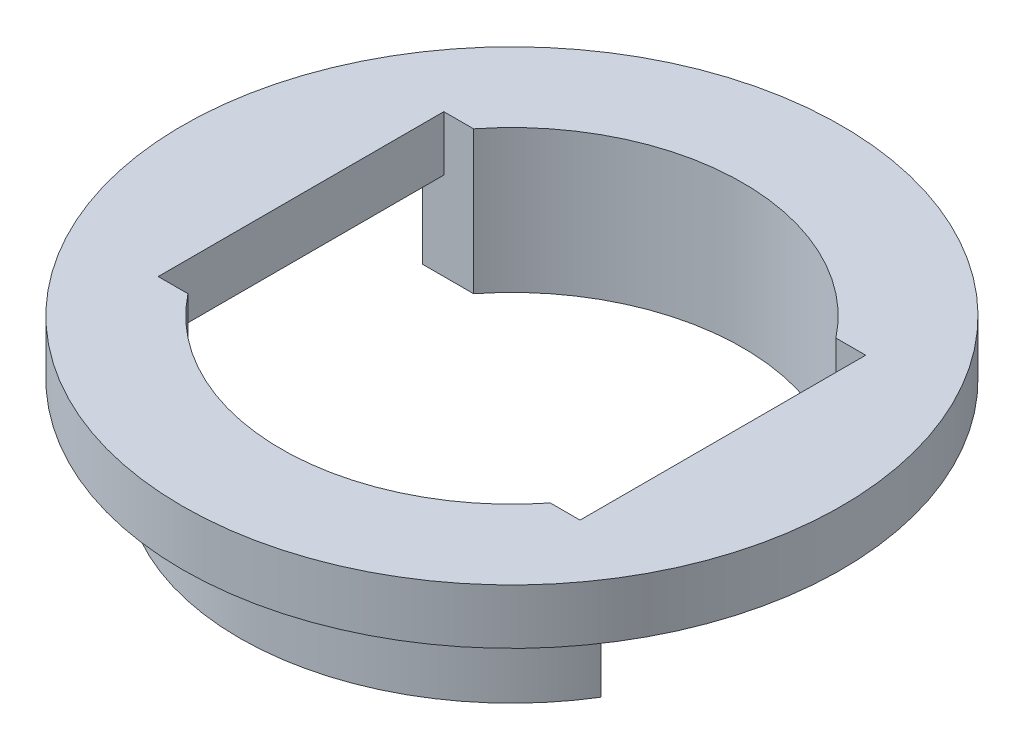
ISO-10303-21;
HEADER;
FILE_DESCRIPTION(('STEP AP214'),'2;1');
FILE_NAME('part.step','',(''),(''),'','','');
FILE_SCHEMA(('AUTOMOTIVE_DESIGN { 1 0 10303 214 1 1 1 1 }'));
ENDSEC;
DATA;
#1=APPLICATION_CONTEXT('core data for automotive mechanical design processes');
#2=APPLICATION_PROTOCOL_DEFINITION('international standard','automotive_design',2000,#1);
#3=PRODUCT_CONTEXT('',#1,'mechanical');
#4=PRODUCT('Part','Part','',(#3));
#5=PRODUCT_RELATED_PRODUCT_CATEGORY('part','',(#4));
#6=PRODUCT_DEFINITION_FORMATION('','',#4);
#7=PRODUCT_DEFINITION_CONTEXT('part definition',#1,'design');
#8=PRODUCT_DEFINITION('design','',#6,#7);
#9=PRODUCT_DEFINITION_SHAPE('','',#8);
#10=(LENGTH_UNIT() NAMED_UNIT(*) SI_UNIT(.MILLI.,.METRE.));
#11=(NAMED_UNIT(*) PLANE_ANGLE_UNIT() SI_UNIT($,.RADIAN.));
#12=(NAMED_UNIT(*) SI_UNIT($,.STERADIAN.) SOLID_ANGLE_UNIT());
#13=UNCERTAINTY_MEASURE_WITH_UNIT(LENGTH_MEASURE(1.E-05),#10,'distance_accuracy_value','');
#14=(GEOMETRIC_REPRESENTATION_CONTEXT(3) GLOBAL_UNCERTAINTY_ASSIGNED_CONTEXT((#13)) GLOBAL_UNIT_ASSIGNED_CONTEXT((#10,
#11,#12)) REPRESENTATION_CONTEXT('',''));
#15=CARTESIAN_POINT('',(0.,0.,0.));
#16=DIRECTION('',(0.,0.,1.));
#17=DIRECTION('',(1.,0.,0.));
#18=AXIS2_PLACEMENT_3D('',#15,#16,#17);
#19=CARTESIAN_POINT('',(0.,2.5,-6.50000000000001));
#20=DIRECTION('',(0.,0.,-1.));
#21=DIRECTION('',(-1.,0.,0.));
#22=AXIS2_PLACEMENT_3D('',#19,#20,#21);
#23=PLANE('',#22);
#24=DIRECTION('',(1.,0.,0.));
#25=VECTOR('',#24,1.);
#26=CARTESIAN_POINT('',(0.,2.5,-6.50000000000001));
#27=LINE('',#26,#25);
#28=CARTESIAN_POINT('',(8.24621125123532,2.5,-6.5));
#29=VERTEX_POINT('',#28);
#30=CARTESIAN_POINT('',(9.6,2.5,-6.5));
#31=VERTEX_POINT('',#30);
#32=EDGE_CURVE('E217',#29,#31,#27,.T.);
#33=ORIENTED_EDGE('',*,*,#32,.F.);
#34=DIRECTION('',(0.,1.,0.));
#35=VECTOR('',#34,1.);
#36=CARTESIAN_POINT('',(8.24621125123532,-4.,-6.5));
#37=LINE('',#36,#35);
#38=CARTESIAN_POINT('',(8.24621125123532,-4.,-6.5));
#39=VERTEX_POINT('',#38);
#40=EDGE_CURVE('E54',#39,#29,#37,.T.);
#41=ORIENTED_EDGE('',*,*,#40,.F.);
#42=DIRECTION('',(-1.,0.,0.));
#43=VECTOR('',#42,1.);
#44=CARTESIAN_POINT('',(0.,-4.,-6.5));
#45=LINE('',#44,#43);
#46=CARTESIAN_POINT('',(10.5598295440788,-4.,-6.5));
#47=VERTEX_POINT('',#46);
#48=EDGE_CURVE('E244',#47,#39,#45,.T.);
#49=ORIENTED_EDGE('',*,*,#48,.F.);
#50=DIRECTION('',(0.,1.,0.));
#51=VECTOR('',#50,1.);
#52=CARTESIAN_POINT('',(10.5598295440788,-4.,-6.5));
#53=LINE('',#52,#51);
#54=CARTESIAN_POINT('',(10.5598295440788,0.,-6.5));
#55=VERTEX_POINT('',#54);
#56=EDGE_CURVE('E227',#47,#55,#53,.T.);
#57=ORIENTED_EDGE('',*,*,#56,.T.);
#58=DIRECTION('',(-1.,0.,0.));
#59=VECTOR('',#58,1.);
#60=CARTESIAN_POINT('',(0.,0.,-6.5));
#61=LINE('',#60,#59);
#62=CARTESIAN_POINT('',(9.6,0.,-6.5));
#63=VERTEX_POINT('',#62);
#64=EDGE_CURVE('E223',#55,#63,#61,.T.);
#65=ORIENTED_EDGE('',*,*,#64,.T.);
#66=DIRECTION('',(0.,-1.,0.));
#67=VECTOR('',#66,1.);
#68=CARTESIAN_POINT('',(9.6,2.5,-6.5));
#69=LINE('',#68,#67);
#70=EDGE_CURVE('E176',#31,#63,#69,.T.);
#71=ORIENTED_EDGE('',*,*,#70,.F.);
#72=EDGE_LOOP('',(#33,#41,#49,#57,#65,#71));
#73=FACE_BOUND('',#72,.T.);
#74=ADVANCED_FACE('F38',(#73),#23,.F.);
#75=CARTESIAN_POINT('',(0.,2.5,6.49999999999999));
#76=DIRECTION('',(0.,0.,1.));
#77=DIRECTION('',(1.,0.,0.));
#78=AXIS2_PLACEMENT_3D('',#75,#76,#77);
#79=PLANE('',#78);
#80=DIRECTION('',(-1.,0.,0.));
#81=VECTOR('',#80,1.);
#82=CARTESIAN_POINT('',(0.,2.5,6.49999999999999));
#83=LINE('',#82,#81);
#84=CARTESIAN_POINT('',(-8.24621125123532,2.5,6.5));
#85=VERTEX_POINT('',#84);
#86=CARTESIAN_POINT('',(-9.6,2.5,6.5));
#87=VERTEX_POINT('',#86);
#88=EDGE_CURVE('E161',#85,#87,#83,.T.);
#89=ORIENTED_EDGE('',*,*,#88,.F.);
#90=DIRECTION('',(0.,1.,0.));
#91=VECTOR('',#90,1.);
#92=CARTESIAN_POINT('',(-8.24621125123532,-4.,6.5));
#93=LINE('',#92,#91);
#94=CARTESIAN_POINT('',(-8.24621125123532,-4.,6.5));
#95=VERTEX_POINT('',#94);
#96=EDGE_CURVE('E149',#95,#85,#93,.T.);
#97=ORIENTED_EDGE('',*,*,#96,.F.);
#98=DIRECTION('',(1.,0.,0.));
#99=VECTOR('',#98,1.);
#100=CARTESIAN_POINT('',(0.,-4.,6.5));
#101=LINE('',#100,#99);
#102=CARTESIAN_POINT('',(-10.5598295440788,-4.,6.5));
#103=VERTEX_POINT('',#102);
#104=EDGE_CURVE('E210',#103,#95,#101,.T.);
#105=ORIENTED_EDGE('',*,*,#104,.F.);
#106=DIRECTION('',(0.,1.,0.));
#107=VECTOR('',#106,1.);
#108=CARTESIAN_POINT('',(-10.5598295440788,-4.,6.5));
#109=LINE('',#108,#107);
#110=CARTESIAN_POINT('',(-10.5598295440788,0.,6.5));
#111=VERTEX_POINT('',#110);
#112=EDGE_CURVE('E201',#103,#111,#109,.T.);
#113=ORIENTED_EDGE('',*,*,#112,.T.);
#114=DIRECTION('',(1.,0.,0.));
#115=VECTOR('',#114,1.);
#116=CARTESIAN_POINT('',(0.,0.,6.5));
#117=LINE('',#116,#115);
#118=CARTESIAN_POINT('',(-9.6,0.,6.5));
#119=VERTEX_POINT('',#118);
#120=EDGE_CURVE('E62',#111,#119,#117,.T.);
#121=ORIENTED_EDGE('',*,*,#120,.T.);
#122=DIRECTION('',(0.,-1.,0.));
#123=VECTOR('',#122,1.);
#124=CARTESIAN_POINT('',(-9.6,2.5,6.5));
#125=LINE('',#124,#123);
#126=EDGE_CURVE('E160',#87,#119,#125,.T.);
#127=ORIENTED_EDGE('',*,*,#126,.F.);
#128=EDGE_LOOP('',(#89,#97,#105,#113,#121,#127));
#129=FACE_BOUND('',#128,.T.);
#130=ADVANCED_FACE('F198',(#129),#79,.F.);
#131=CARTESIAN_POINT('',(0.,0.,0.));
#132=DIRECTION('',(0.,1.,0.));
#133=DIRECTION('',(0.,0.,1.));
#134=AXIS2_PLACEMENT_3D('',#131,#132,#133);
#135=PLANE('',#134);
#136=CARTESIAN_POINT('',(0.,0.,0.));
#137=DIRECTION('',(0.,1.,0.));
#138=DIRECTION('',(0.,0.,1.));
#139=AXIS2_PLACEMENT_3D('',#136,#137,#138);
#140=CIRCLE('',#139,15.);
#141=CARTESIAN_POINT('',(0.,0.,15.));
#142=VERTEX_POINT('',#141);
#143=EDGE_CURVE('E142',#142,#142,#140,.T.);
#144=ORIENTED_EDGE('',*,*,#143,.F.);
#145=EDGE_LOOP('',(#144));
#146=FACE_BOUND('',#145,.T.);
#147=DIRECTION('',(-1.,0.,0.));
#148=VECTOR('',#147,1.);
#149=CARTESIAN_POINT('',(0.,0.,-6.50000000000001));
#150=LINE('',#149,#148);
#151=CARTESIAN_POINT('',(-9.6,0.,-6.50000000000001));
#152=VERTEX_POINT('',#151);
#153=CARTESIAN_POINT('',(-10.5598295440788,0.,-6.5));
#154=VERTEX_POINT('',#153);
#155=EDGE_CURVE('E152',#152,#154,#150,.T.);
#156=ORIENTED_EDGE('',*,*,#155,.F.);
#157=DIRECTION('',(0.,0.,1.));
#158=VECTOR('',#157,1.);
#159=CARTESIAN_POINT('',(-9.6,0.,0.));
#160=LINE('',#159,#158);
#161=EDGE_CURVE('E170',#152,#119,#160,.T.);
#162=ORIENTED_EDGE('',*,*,#161,.T.);
#163=ORIENTED_EDGE('',*,*,#120,.F.);
#164=CARTESIAN_POINT('',(0.,0.,0.));
#165=DIRECTION('',(0.,-1.,0.));
#166=DIRECTION('',(0.,0.,-1.));
#167=AXIS2_PLACEMENT_3D('',#164,#165,#166);
#168=CIRCLE('',#167,12.4);
#169=CARTESIAN_POINT('',(10.5598295440788,0.,6.5));
#170=VERTEX_POINT('',#169);
#171=EDGE_CURVE('E203',#170,#111,#168,.T.);
#172=ORIENTED_EDGE('',*,*,#171,.F.);
#173=DIRECTION('',(1.,0.,0.));
#174=VECTOR('',#173,1.);
#175=CARTESIAN_POINT('',(0.,0.,6.49999999999999));
#176=LINE('',#175,#174);
#177=CARTESIAN_POINT('',(9.6,0.,6.49999999999999));
#178=VERTEX_POINT('',#177);
#179=EDGE_CURVE('E11',#178,#170,#176,.T.);
#180=ORIENTED_EDGE('',*,*,#179,.F.);
#181=DIRECTION('',(0.,0.,1.));
#182=VECTOR('',#181,1.);
#183=CARTESIAN_POINT('',(9.6,0.,0.));
#184=LINE('',#183,#182);
#185=EDGE_CURVE('E172',#63,#178,#184,.T.);
#186=ORIENTED_EDGE('',*,*,#185,.F.);
#187=ORIENTED_EDGE('',*,*,#64,.F.);
#188=CARTESIAN_POINT('',(0.,0.,0.));
#189=DIRECTION('',(0.,-1.,0.));
#190=DIRECTION('',(0.,0.,-1.));
#191=AXIS2_PLACEMENT_3D('',#188,#189,#190);
#192=CIRCLE('',#191,12.4);
#193=EDGE_CURVE('E229',#154,#55,#192,.T.);
#194=ORIENTED_EDGE('',*,*,#193,.F.);
#195=EDGE_LOOP('',(#156,#162,#163,#172,#180,#186,#187,#194));
#196=FACE_BOUND('',#195,.T.);
#197=ADVANCED_FACE('F194',(#146,#196),#135,.F.);
#198=CARTESIAN_POINT('',(-9.6,2.5,0.));
#199=DIRECTION('',(1.,0.,0.));
#200=DIRECTION('',(0.,0.,-1.));
#201=AXIS2_PLACEMENT_3D('',#198,#199,#200);
#202=PLANE('',#201);
#203=ORIENTED_EDGE('',*,*,#161,.F.);
#204=DIRECTION('',(0.,-1.,0.));
#205=VECTOR('',#204,1.);
#206=CARTESIAN_POINT('',(-9.6,2.5,-6.50000000000001));
#207=LINE('',#206,#205);
#208=CARTESIAN_POINT('',(-9.6,2.5,-6.50000000000001));
#209=VERTEX_POINT('',#208);
#210=EDGE_CURVE('E42',#209,#152,#207,.T.);
#211=ORIENTED_EDGE('',*,*,#210,.F.);
#212=DIRECTION('',(0.,0.,1.));
#213=VECTOR('',#212,1.);
#214=CARTESIAN_POINT('',(-9.6,2.5,0.));
#215=LINE('',#214,#213);
#216=EDGE_CURVE('E216',#209,#87,#215,.T.);
#217=ORIENTED_EDGE('',*,*,#216,.T.);
#218=ORIENTED_EDGE('',*,*,#126,.T.);
#219=EDGE_LOOP('',(#203,#211,#217,#218));
#220=FACE_BOUND('',#219,.T.);
#221=ADVANCED_FACE('F192',(#220),#202,.T.);
#222=DIRECTION('',(0.,1.,0.));
#223=VECTOR('',#222,1.);
#224=CARTESIAN_POINT('',(-8.24621125123531,-4.,-6.50000000000001));
#225=LINE('',#224,#223);
#226=CARTESIAN_POINT('',(-8.24621125123531,-4.,-6.50000000000001));
#227=VERTEX_POINT('',#226);
#228=CARTESIAN_POINT('',(-8.24621125123531,2.5,-6.50000000000001));
#229=VERTEX_POINT('',#228);
#230=EDGE_CURVE('E206',#227,#229,#225,.T.);
#231=ORIENTED_EDGE('',*,*,#230,.T.);
#232=EDGE_CURVE('E188',#209,#229,#27,.T.);
#233=ORIENTED_EDGE('',*,*,#232,.F.);
#234=ORIENTED_EDGE('',*,*,#210,.T.);
#235=ORIENTED_EDGE('',*,*,#155,.T.);
#236=DIRECTION('',(0.,1.,0.));
#237=VECTOR('',#236,1.);
#238=CARTESIAN_POINT('',(-10.5598295440788,-4.,-6.5));
#239=LINE('',#238,#237);
#240=CARTESIAN_POINT('',(-10.5598295440788,-4.,-6.5));
#241=VERTEX_POINT('',#240);
#242=EDGE_CURVE('E241',#241,#154,#239,.T.);
#243=ORIENTED_EDGE('',*,*,#242,.F.);
#244=DIRECTION('',(-1.,0.,0.));
#245=VECTOR('',#244,1.);
#246=CARTESIAN_POINT('',(0.,-4.,-6.50000000000001));
#247=LINE('',#246,#245);
#248=EDGE_CURVE('E251',#227,#241,#247,.T.);
#249=ORIENTED_EDGE('',*,*,#248,.F.);
#250=EDGE_LOOP('',(#231,#233,#234,#235,#243,#249));
#251=FACE_BOUND('',#250,.T.);
#252=ADVANCED_FACE('F184',(#251),#23,.F.);
#253=CARTESIAN_POINT('',(9.6,2.5,0.));
#254=DIRECTION('',(1.,0.,0.));
#255=DIRECTION('',(0.,0.,-1.));
#256=AXIS2_PLACEMENT_3D('',#253,#254,#255);
#257=PLANE('',#256);
#258=ORIENTED_EDGE('',*,*,#185,.T.);
#259=DIRECTION('',(0.,-1.,0.));
#260=VECTOR('',#259,1.);
#261=CARTESIAN_POINT('',(9.6,2.5,6.49999999999999));
#262=LINE('',#261,#260);
#263=CARTESIAN_POINT('',(9.6,2.5,6.49999999999999));
#264=VERTEX_POINT('',#263);
#265=EDGE_CURVE('E163',#264,#178,#262,.T.);
#266=ORIENTED_EDGE('',*,*,#265,.F.);
#267=DIRECTION('',(0.,0.,1.));
#268=VECTOR('',#267,1.);
#269=CARTESIAN_POINT('',(9.6,2.5,0.));
#270=LINE('',#269,#268);
#271=EDGE_CURVE('E158',#31,#264,#270,.T.);
#272=ORIENTED_EDGE('',*,*,#271,.F.);
#273=ORIENTED_EDGE('',*,*,#70,.T.);
#274=EDGE_LOOP('',(#258,#266,#272,#273));
#275=FACE_BOUND('',#274,.T.);
#276=ADVANCED_FACE('F220',(#275),#257,.F.);
#277=CARTESIAN_POINT('',(0.,2.5,0.));
#278=DIRECTION('',(0.,-1.,0.));
#279=DIRECTION('',(0.,0.,-1.));
#280=AXIS2_PLACEMENT_3D('',#277,#278,#279);
#281=CYLINDRICAL_SURFACE('',#280,15.);
#282=CARTESIAN_POINT('',(0.,2.5,0.));
#283=DIRECTION('',(0.,1.,0.));
#284=DIRECTION('',(0.,0.,1.));
#285=AXIS2_PLACEMENT_3D('',#282,#283,#284);
#286=CIRCLE('',#285,15.);
#287=CARTESIAN_POINT('',(0.,2.5,15.));
#288=VERTEX_POINT('',#287);
#289=EDGE_CURVE('E174',#288,#288,#286,.T.);
#290=ORIENTED_EDGE('',*,*,#289,.F.);
#291=EDGE_LOOP('',(#290));
#292=FACE_BOUND('',#291,.T.);
#293=ORIENTED_EDGE('',*,*,#143,.T.);
#294=EDGE_LOOP('',(#293));
#295=FACE_BOUND('',#294,.T.);
#296=ADVANCED_FACE('F40',(#292,#295),#281,.T.);
#297=DIRECTION('',(0.,1.,0.));
#298=VECTOR('',#297,1.);
#299=CARTESIAN_POINT('',(8.24621125123533,-4.,6.49999999999999));
#300=LINE('',#299,#298);
#301=CARTESIAN_POINT('',(8.24621125123533,-4.,6.49999999999999));
#302=VERTEX_POINT('',#301);
#303=CARTESIAN_POINT('',(8.24621125123533,2.5,6.49999999999999));
#304=VERTEX_POINT('',#303);
#305=EDGE_CURVE('E130',#302,#304,#300,.T.);
#306=ORIENTED_EDGE('',*,*,#305,.T.);
#307=EDGE_CURVE('E135',#264,#304,#83,.T.);
#308=ORIENTED_EDGE('',*,*,#307,.F.);
#309=ORIENTED_EDGE('',*,*,#265,.T.);
#310=ORIENTED_EDGE('',*,*,#179,.T.);
#311=DIRECTION('',(0.,1.,0.));
#312=VECTOR('',#311,1.);
#313=CARTESIAN_POINT('',(10.5598295440788,-4.,6.5));
#314=LINE('',#313,#312);
#315=CARTESIAN_POINT('',(10.5598295440788,-4.,6.5));
#316=VERTEX_POINT('',#315);
#317=EDGE_CURVE('E143',#316,#170,#314,.T.);
#318=ORIENTED_EDGE('',*,*,#317,.F.);
#319=DIRECTION('',(1.,0.,0.));
#320=VECTOR('',#319,1.);
#321=CARTESIAN_POINT('',(0.,-4.,6.49999999999999));
#322=LINE('',#321,#320);
#323=EDGE_CURVE('E138',#302,#316,#322,.T.);
#324=ORIENTED_EDGE('',*,*,#323,.F.);
#325=EDGE_LOOP('',(#306,#308,#309,#310,#318,#324));
#326=FACE_BOUND('',#325,.T.);
#327=ADVANCED_FACE('F132',(#326),#79,.F.);
#328=CARTESIAN_POINT('',(0.,2.5,0.));
#329=DIRECTION('',(0.,1.,0.));
#330=DIRECTION('',(0.,0.,1.));
#331=AXIS2_PLACEMENT_3D('',#328,#329,#330);
#332=PLANE('',#331);
#333=CARTESIAN_POINT('',(0.,2.5,0.));
#334=DIRECTION('',(0.,-1.,0.));
#335=DIRECTION('',(0.,0.,-1.));
#336=AXIS2_PLACEMENT_3D('',#333,#334,#335);
#337=CIRCLE('',#336,10.5);
#338=EDGE_CURVE('E146',#304,#85,#337,.T.);
#339=ORIENTED_EDGE('',*,*,#338,.T.);
#340=ORIENTED_EDGE('',*,*,#88,.T.);
#341=ORIENTED_EDGE('',*,*,#216,.F.);
#342=ORIENTED_EDGE('',*,*,#232,.T.);
#343=CARTESIAN_POINT('',(0.,2.5,0.));
#344=DIRECTION('',(0.,-1.,0.));
#345=DIRECTION('',(0.,0.,-1.));
#346=AXIS2_PLACEMENT_3D('',#343,#344,#345);
#347=CIRCLE('',#346,10.5);
#348=EDGE_CURVE('E153',#229,#29,#347,.T.);
#349=ORIENTED_EDGE('',*,*,#348,.T.);
#350=ORIENTED_EDGE('',*,*,#32,.T.);
#351=ORIENTED_EDGE('',*,*,#271,.T.);
#352=ORIENTED_EDGE('',*,*,#307,.T.);
#353=EDGE_LOOP('',(#339,#340,#341,#342,#349,#350,#351,#352));
#354=FACE_BOUND('',#353,.T.);
#355=ORIENTED_EDGE('',*,*,#289,.T.);
#356=EDGE_LOOP('',(#355));
#357=FACE_BOUND('',#356,.T.);
#358=ADVANCED_FACE('F155',(#354,#357),#332,.T.);
#359=CARTESIAN_POINT('',(0.,-4.,0.));
#360=DIRECTION('',(0.,1.,0.));
#361=DIRECTION('',(0.,0.,1.));
#362=AXIS2_PLACEMENT_3D('',#359,#360,#361);
#363=CYLINDRICAL_SURFACE('',#362,10.5);
#364=ORIENTED_EDGE('',*,*,#96,.T.);
#365=ORIENTED_EDGE('',*,*,#338,.F.);
#366=ORIENTED_EDGE('',*,*,#305,.F.);
#367=CARTESIAN_POINT('',(0.,-4.,0.));
#368=DIRECTION('',(0.,-1.,0.));
#369=DIRECTION('',(0.,0.,-1.));
#370=AXIS2_PLACEMENT_3D('',#367,#368,#369);
#371=CIRCLE('',#370,10.5);
#372=EDGE_CURVE('E202',#302,#95,#371,.T.);
#373=ORIENTED_EDGE('',*,*,#372,.T.);
#374=EDGE_LOOP('',(#364,#365,#366,#373));
#375=FACE_BOUND('',#374,.T.);
#376=ADVANCED_FACE('F147',(#375),#363,.F.);
#377=CARTESIAN_POINT('',(0.,-4.,0.));
#378=DIRECTION('',(0.,1.,0.));
#379=DIRECTION('',(0.,0.,1.));
#380=AXIS2_PLACEMENT_3D('',#377,#378,#379);
#381=CYLINDRICAL_SURFACE('',#380,12.4);
#382=ORIENTED_EDGE('',*,*,#171,.T.);
#383=ORIENTED_EDGE('',*,*,#112,.F.);
#384=CARTESIAN_POINT('',(0.,-4.,0.));
#385=DIRECTION('',(0.,-1.,0.));
#386=DIRECTION('',(0.,0.,-1.));
#387=AXIS2_PLACEMENT_3D('',#384,#385,#386);
#388=CIRCLE('',#387,12.4);
#389=EDGE_CURVE('E234',#316,#103,#388,.T.);
#390=ORIENTED_EDGE('',*,*,#389,.F.);
#391=ORIENTED_EDGE('',*,*,#317,.T.);
#392=EDGE_LOOP('',(#382,#383,#390,#391));
#393=FACE_BOUND('',#392,.T.);
#394=ADVANCED_FACE('F233',(#393),#381,.T.);
#395=CARTESIAN_POINT('',(0.,-4.,0.));
#396=DIRECTION('',(0.,-1.,0.));
#397=DIRECTION('',(0.,0.,-1.));
#398=AXIS2_PLACEMENT_3D('',#395,#396,#397);
#399=PLANE('',#398);
#400=ORIENTED_EDGE('',*,*,#372,.F.);
#401=ORIENTED_EDGE('',*,*,#323,.T.);
#402=ORIENTED_EDGE('',*,*,#389,.T.);
#403=ORIENTED_EDGE('',*,*,#104,.T.);
#404=EDGE_LOOP('',(#400,#401,#402,#403));
#405=FACE_BOUND('',#404,.T.);
#406=ADVANCED_FACE('F269',(#405),#399,.T.);
#407=CARTESIAN_POINT('',(0.,-4.,0.));
#408=DIRECTION('',(0.,1.,0.));
#409=DIRECTION('',(0.,0.,1.));
#410=AXIS2_PLACEMENT_3D('',#407,#408,#409);
#411=CYLINDRICAL_SURFACE('',#410,10.5);
#412=ORIENTED_EDGE('',*,*,#40,.T.);
#413=ORIENTED_EDGE('',*,*,#348,.F.);
#414=ORIENTED_EDGE('',*,*,#230,.F.);
#415=CARTESIAN_POINT('',(0.,-4.,0.));
#416=DIRECTION('',(0.,-1.,0.));
#417=DIRECTION('',(0.,0.,-1.));
#418=AXIS2_PLACEMENT_3D('',#415,#416,#417);
#419=CIRCLE('',#418,10.5);
#420=EDGE_CURVE('E228',#227,#39,#419,.T.);
#421=ORIENTED_EDGE('',*,*,#420,.T.);
#422=EDGE_LOOP('',(#412,#413,#414,#421));
#423=FACE_BOUND('',#422,.T.);
#424=ADVANCED_FACE('F255',(#423),#411,.F.);
#425=CARTESIAN_POINT('',(0.,-4.,0.));
#426=DIRECTION('',(0.,1.,0.));
#427=DIRECTION('',(0.,0.,1.));
#428=AXIS2_PLACEMENT_3D('',#425,#426,#427);
#429=CYLINDRICAL_SURFACE('',#428,12.4);
#430=ORIENTED_EDGE('',*,*,#193,.T.);
#431=ORIENTED_EDGE('',*,*,#56,.F.);
#432=CARTESIAN_POINT('',(0.,-4.,0.));
#433=DIRECTION('',(0.,-1.,0.));
#434=DIRECTION('',(0.,0.,-1.));
#435=AXIS2_PLACEMENT_3D('',#432,#433,#434);
#436=CIRCLE('',#435,12.4);
#437=EDGE_CURVE('E249',#241,#47,#436,.T.);
#438=ORIENTED_EDGE('',*,*,#437,.F.);
#439=ORIENTED_EDGE('',*,*,#242,.T.);
#440=EDGE_LOOP('',(#430,#431,#438,#439));
#441=FACE_BOUND('',#440,.T.);
#442=ADVANCED_FACE('F261',(#441),#429,.T.);
#443=CARTESIAN_POINT('',(0.,-4.,0.));
#444=DIRECTION('',(0.,-1.,0.));
#445=DIRECTION('',(0.,0.,-1.));
#446=AXIS2_PLACEMENT_3D('',#443,#444,#445);
#447=PLANE('',#446);
#448=ORIENTED_EDGE('',*,*,#420,.F.);
#449=ORIENTED_EDGE('',*,*,#248,.T.);
#450=ORIENTED_EDGE('',*,*,#437,.T.);
#451=ORIENTED_EDGE('',*,*,#48,.T.);
#452=EDGE_LOOP('',(#448,#449,#450,#451));
#453=FACE_BOUND('',#452,.T.);
#454=ADVANCED_FACE('F258',(#453),#447,.T.);
#455=CLOSED_SHELL('',(#74,#130,#197,#221,#252,#276,#296,#327,#358,#376,#394,#406,#424,#442,#454));
#456=MANIFOLD_SOLID_BREP('B2',#455);
#457=ADVANCED_BREP_SHAPE_REPRESENTATION('',(#18,#456),#14);
#458=SHAPE_DEFINITION_REPRESENTATION(#9,#457);
ENDSEC;
END-ISO-10303-21;
